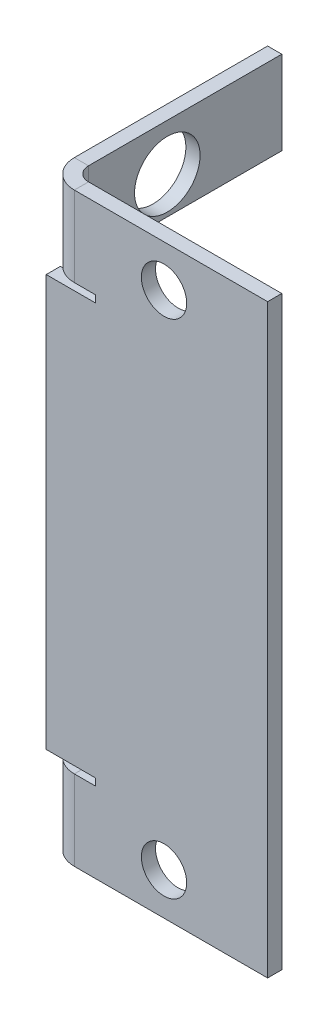
ISO-10303-21;
HEADER;
FILE_DESCRIPTION(('STEP AP214'),'2;1');
FILE_NAME('part.step','',(''),(''),'','','');
FILE_SCHEMA(('AUTOMOTIVE_DESIGN { 1 0 10303 214 1 1 1 1 }'));
ENDSEC;
DATA;
#1=APPLICATION_CONTEXT('core data for automotive mechanical design processes');
#2=APPLICATION_PROTOCOL_DEFINITION('international standard','automotive_design',2000,#1);
#3=PRODUCT_CONTEXT('',#1,'mechanical');
#4=PRODUCT('Part','Part','',(#3));
#5=PRODUCT_RELATED_PRODUCT_CATEGORY('part','',(#4));
#6=PRODUCT_DEFINITION_FORMATION('','',#4);
#7=PRODUCT_DEFINITION_CONTEXT('part definition',#1,'design');
#8=PRODUCT_DEFINITION('design','',#6,#7);
#9=PRODUCT_DEFINITION_SHAPE('','',#8);
#10=(LENGTH_UNIT() NAMED_UNIT(*) SI_UNIT(.MILLI.,.METRE.));
#11=(NAMED_UNIT(*) PLANE_ANGLE_UNIT() SI_UNIT($,.RADIAN.));
#12=(NAMED_UNIT(*) SI_UNIT($,.STERADIAN.) SOLID_ANGLE_UNIT());
#13=UNCERTAINTY_MEASURE_WITH_UNIT(LENGTH_MEASURE(1.E-05),#10,'distance_accuracy_value','');
#14=(GEOMETRIC_REPRESENTATION_CONTEXT(3) GLOBAL_UNCERTAINTY_ASSIGNED_CONTEXT((#13)) GLOBAL_UNIT_ASSIGNED_CONTEXT((#10,
#11,#12)) REPRESENTATION_CONTEXT('',''));
#15=CARTESIAN_POINT('',(0.,0.,0.));
#16=DIRECTION('',(0.,0.,1.));
#17=DIRECTION('',(1.,0.,0.));
#18=AXIS2_PLACEMENT_3D('',#15,#16,#17);
#19=CARTESIAN_POINT('',(1.016,5.746,-1.016));
#20=DIRECTION('',(0.,-1.,0.));
#21=DIRECTION('',(-1.,0.,0.));
#22=AXIS2_PLACEMENT_3D('',#19,#20,#21);
#23=PLANE('',#22);
#24=DIRECTION('',(0.,0.,-1.));
#25=VECTOR('',#24,1.);
#26=CARTESIAN_POINT('',(2.016,5.746,-1.016));
#27=LINE('',#26,#25);
#28=CARTESIAN_POINT('',(2.016,5.746,0.));
#29=VERTEX_POINT('',#28);
#30=CARTESIAN_POINT('',(2.016,5.746,-1.016));
#31=VERTEX_POINT('',#30);
#32=EDGE_CURVE('E11',#29,#31,#27,.T.);
#33=ORIENTED_EDGE('',*,*,#32,.F.);
#34=DIRECTION('',(-1.,0.,0.));
#35=VECTOR('',#34,1.);
#36=CARTESIAN_POINT('',(1.016,5.74600000000001,0.));
#37=LINE('',#36,#35);
#38=CARTESIAN_POINT('',(3.53999999999999,5.74600000000001,0.));
#39=VERTEX_POINT('',#38);
#40=EDGE_CURVE('E142',#39,#29,#37,.T.);
#41=ORIENTED_EDGE('',*,*,#40,.F.);
#42=DIRECTION('',(0.,0.,-1.));
#43=VECTOR('',#42,1.);
#44=CARTESIAN_POINT('',(3.53999999999999,5.746,-1.016));
#45=LINE('',#44,#43);
#46=CARTESIAN_POINT('',(3.53999999999999,5.746,-1.016));
#47=VERTEX_POINT('',#46);
#48=EDGE_CURVE('E54',#39,#47,#45,.T.);
#49=ORIENTED_EDGE('',*,*,#48,.T.);
#50=DIRECTION('',(-1.,0.,0.));
#51=VECTOR('',#50,1.);
#52=CARTESIAN_POINT('',(1.016,5.746,-1.016));
#53=LINE('',#52,#51);
#54=EDGE_CURVE('E145',#47,#31,#53,.T.);
#55=ORIENTED_EDGE('',*,*,#54,.T.);
#56=EDGE_LOOP('',(#33,#41,#49,#55));
#57=FACE_BOUND('',#56,.T.);
#58=ADVANCED_FACE('F44',(#57),#23,.F.);
#59=CARTESIAN_POINT('',(3.53999999999999,42.,-1.016));
#60=DIRECTION('',(1.,0.,0.));
#61=DIRECTION('',(0.,-1.,0.));
#62=AXIS2_PLACEMENT_3D('',#59,#60,#61);
#63=PLANE('',#62);
#64=ORIENTED_EDGE('',*,*,#48,.F.);
#65=DIRECTION('',(0.,1.,0.));
#66=VECTOR('',#65,1.);
#67=CARTESIAN_POINT('',(3.53999999999999,42.,0.));
#68=LINE('',#67,#66);
#69=CARTESIAN_POINT('',(3.53999999999999,6.25400000000001,0.));
#70=VERTEX_POINT('',#69);
#71=EDGE_CURVE('E174',#70,#39,#68,.F.);
#72=ORIENTED_EDGE('',*,*,#71,.F.);
#73=DIRECTION('',(0.,0.,-1.));
#74=VECTOR('',#73,1.);
#75=CARTESIAN_POINT('',(3.53999999999999,6.254,-1.016));
#76=LINE('',#75,#74);
#77=CARTESIAN_POINT('',(3.53999999999999,6.254,-1.016));
#78=VERTEX_POINT('',#77);
#79=EDGE_CURVE('E261',#70,#78,#76,.T.);
#80=ORIENTED_EDGE('',*,*,#79,.T.);
#81=DIRECTION('',(0.,-1.,0.));
#82=VECTOR('',#81,1.);
#83=CARTESIAN_POINT('',(3.53999999999999,42.,-1.016));
#84=LINE('',#83,#82);
#85=EDGE_CURVE('E276',#78,#47,#84,.T.);
#86=ORIENTED_EDGE('',*,*,#85,.T.);
#87=EDGE_LOOP('',(#64,#72,#80,#86));
#88=FACE_BOUND('',#87,.T.);
#89=ADVANCED_FACE('F284',(#88),#63,.F.);
#90=CARTESIAN_POINT('',(1.016,6.254,-1.016));
#91=DIRECTION('',(0.,1.,0.));
#92=DIRECTION('',(1.,0.,0.));
#93=AXIS2_PLACEMENT_3D('',#90,#91,#92);
#94=PLANE('',#93);
#95=ORIENTED_EDGE('',*,*,#79,.F.);
#96=DIRECTION('',(-1.,0.,0.));
#97=VECTOR('',#96,1.);
#98=CARTESIAN_POINT('',(1.016,6.25400000000001,0.));
#99=LINE('',#98,#97);
#100=CARTESIAN_POINT('',(0.,6.25400000000001,0.));
#101=VERTEX_POINT('',#100);
#102=EDGE_CURVE('E176',#101,#70,#99,.F.);
#103=ORIENTED_EDGE('',*,*,#102,.F.);
#104=DIRECTION('',(0.,0.,-1.));
#105=VECTOR('',#104,1.);
#106=CARTESIAN_POINT('',(0.,6.254,-1.016));
#107=LINE('',#106,#105);
#108=CARTESIAN_POINT('',(0.,6.254,-1.016));
#109=VERTEX_POINT('',#108);
#110=EDGE_CURVE('E258',#101,#109,#107,.T.);
#111=ORIENTED_EDGE('',*,*,#110,.T.);
#112=DIRECTION('',(1.,0.,0.));
#113=VECTOR('',#112,1.);
#114=CARTESIAN_POINT('',(1.016,6.254,-1.016));
#115=LINE('',#114,#113);
#116=EDGE_CURVE('E282',#109,#78,#115,.T.);
#117=ORIENTED_EDGE('',*,*,#116,.T.);
#118=EDGE_LOOP('',(#95,#103,#111,#117));
#119=FACE_BOUND('',#118,.T.);
#120=ADVANCED_FACE('F374',(#119),#94,.F.);
#121=CARTESIAN_POINT('',(0.,42.,-1.01599999999999));
#122=DIRECTION('',(-1.,0.,0.));
#123=DIRECTION('',(0.,1.,0.));
#124=AXIS2_PLACEMENT_3D('',#121,#122,#123);
#125=PLANE('',#124);
#126=ORIENTED_EDGE('',*,*,#110,.F.);
#127=DIRECTION('',(0.,1.,0.));
#128=VECTOR('',#127,1.);
#129=CARTESIAN_POINT('',(0.,42.,0.));
#130=LINE('',#129,#128);
#131=CARTESIAN_POINT('',(0.,35.746,0.));
#132=VERTEX_POINT('',#131);
#133=EDGE_CURVE('E339',#101,#132,#130,.T.);
#134=ORIENTED_EDGE('',*,*,#133,.T.);
#135=DIRECTION('',(0.,0.,-1.));
#136=VECTOR('',#135,1.);
#137=CARTESIAN_POINT('',(0.,35.746,-1.016));
#138=LINE('',#137,#136);
#139=CARTESIAN_POINT('',(0.,35.746,-1.016));
#140=VERTEX_POINT('',#139);
#141=EDGE_CURVE('E255',#132,#140,#138,.T.);
#142=ORIENTED_EDGE('',*,*,#141,.T.);
#143=DIRECTION('',(0.,1.,0.));
#144=VECTOR('',#143,1.);
#145=CARTESIAN_POINT('',(0.,42.,-1.01599999999999));
#146=LINE('',#145,#144);
#147=EDGE_CURVE('E381',#109,#140,#146,.T.);
#148=ORIENTED_EDGE('',*,*,#147,.F.);
#149=EDGE_LOOP('',(#126,#134,#142,#148));
#150=FACE_BOUND('',#149,.T.);
#151=ADVANCED_FACE('F385',(#150),#125,.T.);
#152=CARTESIAN_POINT('',(1.016,35.746,-1.016));
#153=DIRECTION('',(0.,-1.,0.));
#154=DIRECTION('',(-1.,0.,0.));
#155=AXIS2_PLACEMENT_3D('',#152,#153,#154);
#156=PLANE('',#155);
#157=ORIENTED_EDGE('',*,*,#141,.F.);
#158=DIRECTION('',(-1.,0.,0.));
#159=VECTOR('',#158,1.);
#160=CARTESIAN_POINT('',(1.016,35.746,0.));
#161=LINE('',#160,#159);
#162=CARTESIAN_POINT('',(3.53999999999999,35.746,0.));
#163=VERTEX_POINT('',#162);
#164=EDGE_CURVE('E364',#163,#132,#161,.T.);
#165=ORIENTED_EDGE('',*,*,#164,.F.);
#166=DIRECTION('',(0.,0.,-1.));
#167=VECTOR('',#166,1.);
#168=CARTESIAN_POINT('',(3.53999999999999,35.746,-1.016));
#169=LINE('',#168,#167);
#170=CARTESIAN_POINT('',(3.53999999999999,35.746,-1.016));
#171=VERTEX_POINT('',#170);
#172=EDGE_CURVE('E252',#163,#171,#169,.T.);
#173=ORIENTED_EDGE('',*,*,#172,.T.);
#174=DIRECTION('',(-1.,0.,0.));
#175=VECTOR('',#174,1.);
#176=CARTESIAN_POINT('',(1.016,35.746,-1.016));
#177=LINE('',#176,#175);
#178=EDGE_CURVE('E285',#171,#140,#177,.T.);
#179=ORIENTED_EDGE('',*,*,#178,.T.);
#180=EDGE_LOOP('',(#157,#165,#173,#179));
#181=FACE_BOUND('',#180,.T.);
#182=ADVANCED_FACE('F871',(#181),#156,.F.);
#183=CARTESIAN_POINT('',(3.53999999999999,42.,-1.016));
#184=DIRECTION('',(1.,0.,0.));
#185=DIRECTION('',(0.,-1.,0.));
#186=AXIS2_PLACEMENT_3D('',#183,#184,#185);
#187=PLANE('',#186);
#188=ORIENTED_EDGE('',*,*,#172,.F.);
#189=DIRECTION('',(0.,1.,0.));
#190=VECTOR('',#189,1.);
#191=CARTESIAN_POINT('',(3.53999999999999,42.,0.));
#192=LINE('',#191,#190);
#193=CARTESIAN_POINT('',(3.53999999999999,36.254,0.));
#194=VERTEX_POINT('',#193);
#195=EDGE_CURVE('E357',#194,#163,#192,.F.);
#196=ORIENTED_EDGE('',*,*,#195,.F.);
#197=DIRECTION('',(0.,0.,-1.));
#198=VECTOR('',#197,1.);
#199=CARTESIAN_POINT('',(3.53999999999999,36.254,-1.016));
#200=LINE('',#199,#198);
#201=CARTESIAN_POINT('',(3.53999999999999,36.254,-1.016));
#202=VERTEX_POINT('',#201);
#203=EDGE_CURVE('E249',#194,#202,#200,.T.);
#204=ORIENTED_EDGE('',*,*,#203,.T.);
#205=DIRECTION('',(0.,-1.,0.));
#206=VECTOR('',#205,1.);
#207=CARTESIAN_POINT('',(3.53999999999999,42.,-1.016));
#208=LINE('',#207,#206);
#209=EDGE_CURVE('E415',#202,#171,#208,.T.);
#210=ORIENTED_EDGE('',*,*,#209,.T.);
#211=EDGE_LOOP('',(#188,#196,#204,#210));
#212=FACE_BOUND('',#211,.T.);
#213=ADVANCED_FACE('F860',(#212),#187,.F.);
#214=CARTESIAN_POINT('',(1.016,36.254,-1.016));
#215=DIRECTION('',(0.,1.,0.));
#216=DIRECTION('',(1.,0.,0.));
#217=AXIS2_PLACEMENT_3D('',#214,#215,#216);
#218=PLANE('',#217);
#219=ORIENTED_EDGE('',*,*,#203,.F.);
#220=DIRECTION('',(-1.,0.,0.));
#221=VECTOR('',#220,1.);
#222=CARTESIAN_POINT('',(1.016,36.254,0.));
#223=LINE('',#222,#221);
#224=CARTESIAN_POINT('',(2.016,36.254,0.));
#225=VERTEX_POINT('',#224);
#226=EDGE_CURVE('E362',#225,#194,#223,.F.);
#227=ORIENTED_EDGE('',*,*,#226,.F.);
#228=DIRECTION('',(0.,0.,-1.));
#229=VECTOR('',#228,1.);
#230=CARTESIAN_POINT('',(2.016,36.254,-1.016));
#231=LINE('',#230,#229);
#232=CARTESIAN_POINT('',(2.016,36.254,-1.016));
#233=VERTEX_POINT('',#232);
#234=EDGE_CURVE('E247',#225,#233,#231,.T.);
#235=ORIENTED_EDGE('',*,*,#234,.T.);
#236=DIRECTION('',(1.,0.,0.));
#237=VECTOR('',#236,1.);
#238=CARTESIAN_POINT('',(1.016,36.254,-1.016));
#239=LINE('',#238,#237);
#240=EDGE_CURVE('E289',#233,#202,#239,.T.);
#241=ORIENTED_EDGE('',*,*,#240,.T.);
#242=EDGE_LOOP('',(#219,#227,#235,#241));
#243=FACE_BOUND('',#242,.T.);
#244=ADVANCED_FACE('F422',(#243),#218,.F.);
#245=CARTESIAN_POINT('',(2.016,36.254,-2.016));
#246=DIRECTION('',(0.,1.,0.));
#247=DIRECTION('',(0.,0.,1.));
#248=AXIS2_PLACEMENT_3D('',#245,#246,#247);
#249=PLANE('',#248);
#250=ORIENTED_EDGE('',*,*,#234,.F.);
#251=CARTESIAN_POINT('',(2.016,36.254,-2.016));
#252=DIRECTION('',(0.,-1.,0.));
#253=DIRECTION('',(0.,0.,-1.));
#254=AXIS2_PLACEMENT_3D('',#251,#252,#253);
#255=CIRCLE('',#254,2.016);
#256=CARTESIAN_POINT('',(0.,36.254,-2.016));
#257=VERTEX_POINT('',#256);
#258=EDGE_CURVE('E346',#225,#257,#255,.T.);
#259=ORIENTED_EDGE('',*,*,#258,.T.);
#260=DIRECTION('',(1.,0.,0.));
#261=VECTOR('',#260,1.);
#262=CARTESIAN_POINT('',(1.016,36.254,-2.016));
#263=LINE('',#262,#261);
#264=CARTESIAN_POINT('',(1.016,36.254,-2.016));
#265=VERTEX_POINT('',#264);
#266=EDGE_CURVE('E244',#257,#265,#263,.T.);
#267=ORIENTED_EDGE('',*,*,#266,.T.);
#268=CARTESIAN_POINT('',(2.016,36.254,-2.016));
#269=DIRECTION('',(0.,-1.,0.));
#270=DIRECTION('',(0.,0.,-1.));
#271=AXIS2_PLACEMENT_3D('',#268,#269,#270);
#272=CIRCLE('',#271,1.);
#273=EDGE_CURVE('E315',#233,#265,#272,.T.);
#274=ORIENTED_EDGE('',*,*,#273,.F.);
#275=EDGE_LOOP('',(#250,#259,#267,#274));
#276=FACE_BOUND('',#275,.T.);
#277=ADVANCED_FACE('F428',(#276),#249,.F.);
#278=CARTESIAN_POINT('',(1.016,36.254,-1.016));
#279=DIRECTION('',(0.,1.,0.));
#280=DIRECTION('',(0.,0.,-1.));
#281=AXIS2_PLACEMENT_3D('',#278,#279,#280);
#282=PLANE('',#281);
#283=ORIENTED_EDGE('',*,*,#266,.F.);
#284=DIRECTION('',(0.,0.,1.));
#285=VECTOR('',#284,1.);
#286=CARTESIAN_POINT('',(0.,36.254,-1.016));
#287=LINE('',#286,#285);
#288=CARTESIAN_POINT('',(0.,36.254,-3.53999999999999));
#289=VERTEX_POINT('',#288);
#290=EDGE_CURVE('E194',#257,#289,#287,.F.);
#291=ORIENTED_EDGE('',*,*,#290,.T.);
#292=DIRECTION('',(1.,0.,0.));
#293=VECTOR('',#292,1.);
#294=CARTESIAN_POINT('',(1.016,36.254,-3.53999999999999));
#295=LINE('',#294,#293);
#296=CARTESIAN_POINT('',(1.016,36.254,-3.53999999999999));
#297=VERTEX_POINT('',#296);
#298=EDGE_CURVE('E241',#289,#297,#295,.T.);
#299=ORIENTED_EDGE('',*,*,#298,.T.);
#300=DIRECTION('',(0.,0.,-1.));
#301=VECTOR('',#300,1.);
#302=CARTESIAN_POINT('',(1.016,36.254,-1.016));
#303=LINE('',#302,#301);
#304=EDGE_CURVE('E409',#265,#297,#303,.T.);
#305=ORIENTED_EDGE('',*,*,#304,.F.);
#306=EDGE_LOOP('',(#283,#291,#299,#305));
#307=FACE_BOUND('',#306,.T.);
#308=ADVANCED_FACE('F825',(#307),#282,.F.);
#309=CARTESIAN_POINT('',(1.016,42.,-3.53999999999999));
#310=DIRECTION('',(0.,0.,-1.));
#311=DIRECTION('',(0.,-1.,0.));
#312=AXIS2_PLACEMENT_3D('',#309,#310,#311);
#313=PLANE('',#312);
#314=ORIENTED_EDGE('',*,*,#298,.F.);
#315=DIRECTION('',(0.,1.,0.));
#316=VECTOR('',#315,1.);
#317=CARTESIAN_POINT('',(0.,42.,-3.53999999999999));
#318=LINE('',#317,#316);
#319=CARTESIAN_POINT('',(0.,36.,-3.53999999999999));
#320=VERTEX_POINT('',#319);
#321=EDGE_CURVE('E354',#289,#320,#318,.F.);
#322=ORIENTED_EDGE('',*,*,#321,.T.);
#323=DIRECTION('',(1.,0.,0.));
#324=VECTOR('',#323,1.);
#325=CARTESIAN_POINT('',(1.016,36.,-3.53999999999999));
#326=LINE('',#325,#324);
#327=CARTESIAN_POINT('',(1.016,36.,-3.53999999999999));
#328=VERTEX_POINT('',#327);
#329=EDGE_CURVE('E238',#320,#328,#326,.T.);
#330=ORIENTED_EDGE('',*,*,#329,.T.);
#331=DIRECTION('',(0.,-1.,0.));
#332=VECTOR('',#331,1.);
#333=CARTESIAN_POINT('',(1.016,42.,-3.53999999999999));
#334=LINE('',#333,#332);
#335=EDGE_CURVE('E412',#297,#328,#334,.T.);
#336=ORIENTED_EDGE('',*,*,#335,.F.);
#337=EDGE_LOOP('',(#314,#322,#330,#336));
#338=FACE_BOUND('',#337,.T.);
#339=ADVANCED_FACE('F813',(#338),#313,.F.);
#340=CARTESIAN_POINT('',(1.016,36.,-15.875));
#341=DIRECTION('',(0.,-1.,0.));
#342=DIRECTION('',(0.,0.,1.));
#343=AXIS2_PLACEMENT_3D('',#340,#341,#342);
#344=PLANE('',#343);
#345=ORIENTED_EDGE('',*,*,#329,.F.);
#346=DIRECTION('',(0.,0.,1.));
#347=VECTOR('',#346,1.);
#348=CARTESIAN_POINT('',(0.,36.,-1.016));
#349=LINE('',#348,#347);
#350=CARTESIAN_POINT('',(0.,36.,-15.875));
#351=VERTEX_POINT('',#350);
#352=EDGE_CURVE('E185',#351,#320,#349,.T.);
#353=ORIENTED_EDGE('',*,*,#352,.F.);
#354=DIRECTION('',(1.,0.,0.));
#355=VECTOR('',#354,1.);
#356=CARTESIAN_POINT('',(1.016,36.,-15.875));
#357=LINE('',#356,#355);
#358=CARTESIAN_POINT('',(1.016,36.,-15.875));
#359=VERTEX_POINT('',#358);
#360=EDGE_CURVE('E235',#351,#359,#357,.T.);
#361=ORIENTED_EDGE('',*,*,#360,.T.);
#362=DIRECTION('',(0.,0.,1.));
#363=VECTOR('',#362,1.);
#364=CARTESIAN_POINT('',(1.016,36.,-15.875));
#365=LINE('',#364,#363);
#366=EDGE_CURVE('E477',#359,#328,#365,.T.);
#367=ORIENTED_EDGE('',*,*,#366,.T.);
#368=EDGE_LOOP('',(#345,#353,#361,#367));
#369=FACE_BOUND('',#368,.T.);
#370=ADVANCED_FACE('F475',(#369),#344,.T.);
#371=CARTESIAN_POINT('',(1.016,42.,-15.875));
#372=DIRECTION('',(0.,0.,-1.));
#373=DIRECTION('',(0.,-1.,0.));
#374=AXIS2_PLACEMENT_3D('',#371,#372,#373);
#375=PLANE('',#374);
#376=ORIENTED_EDGE('',*,*,#360,.F.);
#377=DIRECTION('',(0.,1.,0.));
#378=VECTOR('',#377,1.);
#379=CARTESIAN_POINT('',(0.,42.,-15.875));
#380=LINE('',#379,#378);
#381=CARTESIAN_POINT('',(0.,42.,-15.875));
#382=VERTEX_POINT('',#381);
#383=EDGE_CURVE('E349',#382,#351,#380,.F.);
#384=ORIENTED_EDGE('',*,*,#383,.F.);
#385=DIRECTION('',(1.,0.,0.));
#386=VECTOR('',#385,1.);
#387=CARTESIAN_POINT('',(1.016,42.,-15.875));
#388=LINE('',#387,#386);
#389=CARTESIAN_POINT('',(1.016,42.,-15.875));
#390=VERTEX_POINT('',#389);
#391=EDGE_CURVE('E232',#382,#390,#388,.T.);
#392=ORIENTED_EDGE('',*,*,#391,.T.);
#393=DIRECTION('',(0.,-1.,0.));
#394=VECTOR('',#393,1.);
#395=CARTESIAN_POINT('',(1.016,42.,-15.875));
#396=LINE('',#395,#394);
#397=EDGE_CURVE('E471',#390,#359,#396,.T.);
#398=ORIENTED_EDGE('',*,*,#397,.T.);
#399=EDGE_LOOP('',(#376,#384,#392,#398));
#400=FACE_BOUND('',#399,.T.);
#401=ADVANCED_FACE('F468',(#400),#375,.T.);
#402=CARTESIAN_POINT('',(1.016,42.,-1.016));
#403=DIRECTION('',(0.,1.,0.));
#404=DIRECTION('',(0.,0.,-1.));
#405=AXIS2_PLACEMENT_3D('',#402,#403,#404);
#406=PLANE('',#405);
#407=ORIENTED_EDGE('',*,*,#391,.F.);
#408=DIRECTION('',(0.,0.,1.));
#409=VECTOR('',#408,1.);
#410=CARTESIAN_POINT('',(0.,42.,-1.016));
#411=LINE('',#410,#409);
#412=CARTESIAN_POINT('',(0.,42.,-2.016));
#413=VERTEX_POINT('',#412);
#414=EDGE_CURVE('E200',#413,#382,#411,.F.);
#415=ORIENTED_EDGE('',*,*,#414,.F.);
#416=DIRECTION('',(1.,0.,0.));
#417=VECTOR('',#416,1.);
#418=CARTESIAN_POINT('',(1.016,42.,-2.016));
#419=LINE('',#418,#417);
#420=CARTESIAN_POINT('',(1.016,42.,-2.016));
#421=VERTEX_POINT('',#420);
#422=EDGE_CURVE('E229',#413,#421,#419,.T.);
#423=ORIENTED_EDGE('',*,*,#422,.T.);
#424=DIRECTION('',(0.,0.,-1.));
#425=VECTOR('',#424,1.);
#426=CARTESIAN_POINT('',(1.016,42.,-1.016));
#427=LINE('',#426,#425);
#428=EDGE_CURVE('E483',#421,#390,#427,.T.);
#429=ORIENTED_EDGE('',*,*,#428,.T.);
#430=EDGE_LOOP('',(#407,#415,#423,#429));
#431=FACE_BOUND('',#430,.T.);
#432=ADVANCED_FACE('F460',(#431),#406,.T.);
#433=CARTESIAN_POINT('',(2.016,42.,-2.016));
#434=DIRECTION('',(0.,-1.,0.));
#435=DIRECTION('',(0.,0.,-1.));
#436=AXIS2_PLACEMENT_3D('',#433,#434,#435);
#437=PLANE('',#436);
#438=ORIENTED_EDGE('',*,*,#422,.F.);
#439=CARTESIAN_POINT('',(2.016,42.,-2.016));
#440=DIRECTION('',(0.,-1.,0.));
#441=DIRECTION('',(0.,0.,-1.));
#442=AXIS2_PLACEMENT_3D('',#439,#440,#441);
#443=CIRCLE('',#442,2.016);
#444=CARTESIAN_POINT('',(2.016,42.,0.));
#445=VERTEX_POINT('',#444);
#446=EDGE_CURVE('E187',#413,#445,#443,.F.);
#447=ORIENTED_EDGE('',*,*,#446,.T.);
#448=DIRECTION('',(0.,0.,-1.));
#449=VECTOR('',#448,1.);
#450=CARTESIAN_POINT('',(2.016,42.,-1.016));
#451=LINE('',#450,#449);
#452=CARTESIAN_POINT('',(2.016,42.,-1.016));
#453=VERTEX_POINT('',#452);
#454=EDGE_CURVE('E62',#445,#453,#451,.T.);
#455=ORIENTED_EDGE('',*,*,#454,.T.);
#456=CARTESIAN_POINT('',(2.016,42.,-2.016));
#457=DIRECTION('',(0.,1.,0.));
#458=DIRECTION('',(0.,0.,1.));
#459=AXIS2_PLACEMENT_3D('',#456,#457,#458);
#460=CIRCLE('',#459,1.);
#461=EDGE_CURVE('E307',#421,#453,#460,.T.);
#462=ORIENTED_EDGE('',*,*,#461,.F.);
#463=EDGE_LOOP('',(#438,#447,#455,#462));
#464=FACE_BOUND('',#463,.T.);
#465=ADVANCED_FACE('F453',(#464),#437,.F.);
#466=CARTESIAN_POINT('',(1.016,42.,-1.016));
#467=DIRECTION('',(0.,1.,0.));
#468=DIRECTION('',(1.,0.,0.));
#469=AXIS2_PLACEMENT_3D('',#466,#467,#468);
#470=PLANE('',#469);
#471=ORIENTED_EDGE('',*,*,#454,.F.);
#472=DIRECTION('',(-1.,0.,0.));
#473=VECTOR('',#472,1.);
#474=CARTESIAN_POINT('',(1.016,42.,0.));
#475=LINE('',#474,#473);
#476=CARTESIAN_POINT('',(15.875,42.,0.));
#477=VERTEX_POINT('',#476);
#478=EDGE_CURVE('E342',#445,#477,#475,.F.);
#479=ORIENTED_EDGE('',*,*,#478,.T.);
#480=DIRECTION('',(0.,0.,-1.));
#481=VECTOR('',#480,1.);
#482=CARTESIAN_POINT('',(15.875,42.,-1.016));
#483=LINE('',#482,#481);
#484=CARTESIAN_POINT('',(15.875,42.,-1.016));
#485=VERTEX_POINT('',#484);
#486=EDGE_CURVE('E225',#477,#485,#483,.T.);
#487=ORIENTED_EDGE('',*,*,#486,.T.);
#488=DIRECTION('',(1.,0.,0.));
#489=VECTOR('',#488,1.);
#490=CARTESIAN_POINT('',(1.016,42.,-1.016));
#491=LINE('',#490,#489);
#492=EDGE_CURVE('E386',#453,#485,#491,.T.);
#493=ORIENTED_EDGE('',*,*,#492,.F.);
#494=EDGE_LOOP('',(#471,#479,#487,#493));
#495=FACE_BOUND('',#494,.T.);
#496=ADVANCED_FACE('F437',(#495),#470,.T.);
#497=CARTESIAN_POINT('',(15.875,42.,-1.016));
#498=DIRECTION('',(1.,0.,0.));
#499=DIRECTION('',(0.,-1.,0.));
#500=AXIS2_PLACEMENT_3D('',#497,#498,#499);
#501=PLANE('',#500);
#502=ORIENTED_EDGE('',*,*,#486,.F.);
#503=DIRECTION('',(0.,1.,0.));
#504=VECTOR('',#503,1.);
#505=CARTESIAN_POINT('',(15.875,42.,0.));
#506=LINE('',#505,#504);
#507=CARTESIAN_POINT('',(15.875,0.,0.));
#508=VERTEX_POINT('',#507);
#509=EDGE_CURVE('E335',#477,#508,#506,.F.);
#510=ORIENTED_EDGE('',*,*,#509,.T.);
#511=DIRECTION('',(0.,0.,-1.));
#512=VECTOR('',#511,1.);
#513=CARTESIAN_POINT('',(15.875,0.,-1.016));
#514=LINE('',#513,#512);
#515=CARTESIAN_POINT('',(15.875,0.,-1.016));
#516=VERTEX_POINT('',#515);
#517=EDGE_CURVE('E222',#508,#516,#514,.T.);
#518=ORIENTED_EDGE('',*,*,#517,.T.);
#519=DIRECTION('',(0.,-1.,0.));
#520=VECTOR('',#519,1.);
#521=CARTESIAN_POINT('',(15.875,42.,-1.016));
#522=LINE('',#521,#520);
#523=EDGE_CURVE('E390',#485,#516,#522,.T.);
#524=ORIENTED_EDGE('',*,*,#523,.F.);
#525=EDGE_LOOP('',(#502,#510,#518,#524));
#526=FACE_BOUND('',#525,.T.);
#527=ADVANCED_FACE('F444',(#526),#501,.T.);
#528=CARTESIAN_POINT('',(1.016,0.,-1.016));
#529=DIRECTION('',(0.,1.,0.));
#530=DIRECTION('',(1.,0.,0.));
#531=AXIS2_PLACEMENT_3D('',#528,#529,#530);
#532=PLANE('',#531);
#533=ORIENTED_EDGE('',*,*,#517,.F.);
#534=DIRECTION('',(-1.,0.,0.));
#535=VECTOR('',#534,1.);
#536=CARTESIAN_POINT('',(1.016,0.,0.));
#537=LINE('',#536,#535);
#538=CARTESIAN_POINT('',(2.016,0.,0.));
#539=VERTEX_POINT('',#538);
#540=EDGE_CURVE('E202',#539,#508,#537,.F.);
#541=ORIENTED_EDGE('',*,*,#540,.F.);
#542=DIRECTION('',(0.,0.,-1.));
#543=VECTOR('',#542,1.);
#544=CARTESIAN_POINT('',(2.016,0.,-1.016));
#545=LINE('',#544,#543);
#546=CARTESIAN_POINT('',(2.016,0.,-1.016));
#547=VERTEX_POINT('',#546);
#548=EDGE_CURVE('E219',#539,#547,#545,.T.);
#549=ORIENTED_EDGE('',*,*,#548,.T.);
#550=DIRECTION('',(1.,0.,0.));
#551=VECTOR('',#550,1.);
#552=CARTESIAN_POINT('',(1.016,0.,-1.016));
#553=LINE('',#552,#551);
#554=EDGE_CURVE('E387',#547,#516,#553,.T.);
#555=ORIENTED_EDGE('',*,*,#554,.T.);
#556=EDGE_LOOP('',(#533,#541,#549,#555));
#557=FACE_BOUND('',#556,.T.);
#558=ADVANCED_FACE('F449',(#557),#532,.F.);
#559=CARTESIAN_POINT('',(2.016,0.,-2.016));
#560=DIRECTION('',(0.,1.,0.));
#561=DIRECTION('',(0.,0.,1.));
#562=AXIS2_PLACEMENT_3D('',#559,#560,#561);
#563=PLANE('',#562);
#564=ORIENTED_EDGE('',*,*,#548,.F.);
#565=CARTESIAN_POINT('',(2.016,0.,-2.016));
#566=DIRECTION('',(0.,-1.,0.));
#567=DIRECTION('',(0.,0.,-1.));
#568=AXIS2_PLACEMENT_3D('',#565,#566,#567);
#569=CIRCLE('',#568,2.016);
#570=CARTESIAN_POINT('',(0.,0.,-2.016));
#571=VERTEX_POINT('',#570);
#572=EDGE_CURVE('E161',#539,#571,#569,.T.);
#573=ORIENTED_EDGE('',*,*,#572,.T.);
#574=DIRECTION('',(1.,0.,0.));
#575=VECTOR('',#574,1.);
#576=CARTESIAN_POINT('',(1.016,0.,-2.016));
#577=LINE('',#576,#575);
#578=CARTESIAN_POINT('',(1.016,0.,-2.016));
#579=VERTEX_POINT('',#578);
#580=EDGE_CURVE('E216',#571,#579,#577,.T.);
#581=ORIENTED_EDGE('',*,*,#580,.T.);
#582=CARTESIAN_POINT('',(2.016,0.,-2.016));
#583=DIRECTION('',(0.,-1.,0.));
#584=DIRECTION('',(0.,0.,-1.));
#585=AXIS2_PLACEMENT_3D('',#582,#583,#584);
#586=CIRCLE('',#585,1.);
#587=EDGE_CURVE('E303',#547,#579,#586,.T.);
#588=ORIENTED_EDGE('',*,*,#587,.F.);
#589=EDGE_LOOP('',(#564,#573,#581,#588));
#590=FACE_BOUND('',#589,.T.);
#591=ADVANCED_FACE('F727',(#590),#563,.F.);
#592=CARTESIAN_POINT('',(1.016,0.,-1.016));
#593=DIRECTION('',(0.,1.,0.));
#594=DIRECTION('',(0.,0.,-1.));
#595=AXIS2_PLACEMENT_3D('',#592,#593,#594);
#596=PLANE('',#595);
#597=ORIENTED_EDGE('',*,*,#580,.F.);
#598=DIRECTION('',(0.,0.,1.));
#599=VECTOR('',#598,1.);
#600=CARTESIAN_POINT('',(0.,0.,-1.016));
#601=LINE('',#600,#599);
#602=CARTESIAN_POINT('',(0.,0.,-15.875));
#603=VERTEX_POINT('',#602);
#604=EDGE_CURVE('E195',#571,#603,#601,.F.);
#605=ORIENTED_EDGE('',*,*,#604,.T.);
#606=DIRECTION('',(1.,0.,0.));
#607=VECTOR('',#606,1.);
#608=CARTESIAN_POINT('',(1.016,0.,-15.875));
#609=LINE('',#608,#607);
#610=CARTESIAN_POINT('',(1.016,0.,-15.875));
#611=VERTEX_POINT('',#610);
#612=EDGE_CURVE('E213',#603,#611,#609,.T.);
#613=ORIENTED_EDGE('',*,*,#612,.T.);
#614=DIRECTION('',(0.,0.,-1.));
#615=VECTOR('',#614,1.);
#616=CARTESIAN_POINT('',(1.016,0.,-1.016));
#617=LINE('',#616,#615);
#618=EDGE_CURVE('E403',#579,#611,#617,.T.);
#619=ORIENTED_EDGE('',*,*,#618,.F.);
#620=EDGE_LOOP('',(#597,#605,#613,#619));
#621=FACE_BOUND('',#620,.T.);
#622=ADVANCED_FACE('F714',(#621),#596,.F.);
#623=ORIENTED_EDGE('',*,*,#612,.F.);
#624=DIRECTION('',(0.,1.,0.));
#625=VECTOR('',#624,1.);
#626=CARTESIAN_POINT('',(0.,42.,-15.875));
#627=LINE('',#626,#625);
#628=CARTESIAN_POINT('',(0.,6.00000000000001,-15.875));
#629=VERTEX_POINT('',#628);
#630=EDGE_CURVE('E332',#629,#603,#627,.F.);
#631=ORIENTED_EDGE('',*,*,#630,.F.);
#632=DIRECTION('',(1.,0.,0.));
#633=VECTOR('',#632,1.);
#634=CARTESIAN_POINT('',(1.016,6.,-15.875));
#635=LINE('',#634,#633);
#636=CARTESIAN_POINT('',(1.016,6.,-15.875));
#637=VERTEX_POINT('',#636);
#638=EDGE_CURVE('E210',#629,#637,#635,.T.);
#639=ORIENTED_EDGE('',*,*,#638,.T.);
#640=EDGE_CURVE('E399',#637,#611,#396,.T.);
#641=ORIENTED_EDGE('',*,*,#640,.T.);
#642=EDGE_LOOP('',(#623,#631,#639,#641));
#643=FACE_BOUND('',#642,.T.);
#644=ADVANCED_FACE('F701',(#643),#375,.T.);
#645=CARTESIAN_POINT('',(1.016,6.,-1.016));
#646=DIRECTION('',(0.,1.,0.));
#647=DIRECTION('',(0.,0.,-1.));
#648=AXIS2_PLACEMENT_3D('',#645,#646,#647);
#649=PLANE('',#648);
#650=ORIENTED_EDGE('',*,*,#638,.F.);
#651=DIRECTION('',(0.,0.,1.));
#652=VECTOR('',#651,1.);
#653=CARTESIAN_POINT('',(0.,6.00000000000001,-1.016));
#654=LINE('',#653,#652);
#655=CARTESIAN_POINT('',(0.,6.00000000000001,-3.53999999999998));
#656=VERTEX_POINT('',#655);
#657=EDGE_CURVE('E329',#656,#629,#654,.F.);
#658=ORIENTED_EDGE('',*,*,#657,.F.);
#659=DIRECTION('',(1.,0.,0.));
#660=VECTOR('',#659,1.);
#661=CARTESIAN_POINT('',(1.016,6.,-3.53999999999998));
#662=LINE('',#661,#660);
#663=CARTESIAN_POINT('',(1.016,6.,-3.53999999999998));
#664=VERTEX_POINT('',#663);
#665=EDGE_CURVE('E207',#656,#664,#662,.T.);
#666=ORIENTED_EDGE('',*,*,#665,.T.);
#667=DIRECTION('',(0.,0.,-1.));
#668=VECTOR('',#667,1.);
#669=CARTESIAN_POINT('',(1.016,6.,-1.016));
#670=LINE('',#669,#668);
#671=EDGE_CURVE('E400',#664,#637,#670,.T.);
#672=ORIENTED_EDGE('',*,*,#671,.T.);
#673=EDGE_LOOP('',(#650,#658,#666,#672));
#674=FACE_BOUND('',#673,.T.);
#675=ADVANCED_FACE('F688',(#674),#649,.T.);
#676=CARTESIAN_POINT('',(1.016,42.,-3.53999999999998));
#677=DIRECTION('',(0.,0.,-1.));
#678=DIRECTION('',(0.,-1.,0.));
#679=AXIS2_PLACEMENT_3D('',#676,#677,#678);
#680=PLANE('',#679);
#681=ORIENTED_EDGE('',*,*,#665,.F.);
#682=DIRECTION('',(0.,1.,0.));
#683=VECTOR('',#682,1.);
#684=CARTESIAN_POINT('',(0.,42.,-3.53999999999998));
#685=LINE('',#684,#683);
#686=CARTESIAN_POINT('',(0.,5.74600000000001,-3.53999999999998));
#687=VERTEX_POINT('',#686);
#688=EDGE_CURVE('E175',#656,#687,#685,.F.);
#689=ORIENTED_EDGE('',*,*,#688,.T.);
#690=DIRECTION('',(1.,0.,0.));
#691=VECTOR('',#690,1.);
#692=CARTESIAN_POINT('',(1.016,5.746,-3.53999999999998));
#693=LINE('',#692,#691);
#694=CARTESIAN_POINT('',(1.016,5.746,-3.53999999999998));
#695=VERTEX_POINT('',#694);
#696=EDGE_CURVE('E204',#687,#695,#693,.T.);
#697=ORIENTED_EDGE('',*,*,#696,.T.);
#698=DIRECTION('',(0.,-1.,0.));
#699=VECTOR('',#698,1.);
#700=CARTESIAN_POINT('',(1.016,42.,-3.53999999999998));
#701=LINE('',#700,#699);
#702=EDGE_CURVE('E281',#664,#695,#701,.T.);
#703=ORIENTED_EDGE('',*,*,#702,.F.);
#704=EDGE_LOOP('',(#681,#689,#697,#703));
#705=FACE_BOUND('',#704,.T.);
#706=ADVANCED_FACE('F676',(#705),#680,.F.);
#707=CARTESIAN_POINT('',(1.016,5.746,-1.01600000000001));
#708=DIRECTION('',(0.,-1.,0.));
#709=DIRECTION('',(0.,0.,1.));
#710=AXIS2_PLACEMENT_3D('',#707,#708,#709);
#711=PLANE('',#710);
#712=ORIENTED_EDGE('',*,*,#696,.F.);
#713=DIRECTION('',(0.,0.,1.));
#714=VECTOR('',#713,1.);
#715=CARTESIAN_POINT('',(0.,5.74600000000001,-1.016));
#716=LINE('',#715,#714);
#717=CARTESIAN_POINT('',(0.,5.74600000000001,-2.016));
#718=VERTEX_POINT('',#717);
#719=EDGE_CURVE('E320',#687,#718,#716,.T.);
#720=ORIENTED_EDGE('',*,*,#719,.T.);
#721=DIRECTION('',(1.,0.,0.));
#722=VECTOR('',#721,1.);
#723=CARTESIAN_POINT('',(1.016,5.746,-2.016));
#724=LINE('',#723,#722);
#725=CARTESIAN_POINT('',(1.016,5.746,-2.016));
#726=VERTEX_POINT('',#725);
#727=EDGE_CURVE('E48',#718,#726,#724,.T.);
#728=ORIENTED_EDGE('',*,*,#727,.T.);
#729=DIRECTION('',(0.,0.,1.));
#730=VECTOR('',#729,1.);
#731=CARTESIAN_POINT('',(1.016,5.746,-1.01600000000001));
#732=LINE('',#731,#730);
#733=EDGE_CURVE('E295',#695,#726,#732,.T.);
#734=ORIENTED_EDGE('',*,*,#733,.F.);
#735=EDGE_LOOP('',(#712,#720,#728,#734));
#736=FACE_BOUND('',#735,.T.);
#737=ADVANCED_FACE('F664',(#736),#711,.F.);
#738=CARTESIAN_POINT('',(1.016,38.65,-7.666));
#739=DIRECTION('',(1.,0.,0.));
#740=DIRECTION('',(0.,0.,-1.));
#741=AXIS2_PLACEMENT_3D('',#738,#739,#740);
#742=CYLINDRICAL_SURFACE('',#741,2.35);
#743=CARTESIAN_POINT('',(1.016,38.65,-7.666));
#744=DIRECTION('',(1.,0.,0.));
#745=DIRECTION('',(0.,0.,-1.));
#746=AXIS2_PLACEMENT_3D('',#743,#744,#745);
#747=CIRCLE('',#746,2.35);
#748=CARTESIAN_POINT('',(1.016,38.65,-10.016));
#749=VERTEX_POINT('',#748);
#750=EDGE_CURVE('E309',#749,#749,#747,.T.);
#751=ORIENTED_EDGE('',*,*,#750,.T.);
#752=EDGE_LOOP('',(#751));
#753=FACE_BOUND('',#752,.T.);
#754=CARTESIAN_POINT('',(0.,38.65,-7.666));
#755=DIRECTION('',(1.,0.,0.));
#756=DIRECTION('',(0.,0.,-1.));
#757=AXIS2_PLACEMENT_3D('',#754,#755,#756);
#758=CIRCLE('',#757,2.35);
#759=CARTESIAN_POINT('',(0.,38.65,-10.016));
#760=VERTEX_POINT('',#759);
#761=EDGE_CURVE('E182',#760,#760,#758,.T.);
#762=ORIENTED_EDGE('',*,*,#761,.F.);
#763=EDGE_LOOP('',(#762));
#764=FACE_BOUND('',#763,.T.);
#765=ADVANCED_FACE('F46',(#753,#764),#742,.F.);
#766=CARTESIAN_POINT('',(8.4455,3.,-1.016));
#767=DIRECTION('',(0.,0.,-1.));
#768=DIRECTION('',(-1.,0.,0.));
#769=AXIS2_PLACEMENT_3D('',#766,#767,#768);
#770=CYLINDRICAL_SURFACE('',#769,1.625);
#771=CARTESIAN_POINT('',(8.4455,3.,-1.016));
#772=DIRECTION('',(0.,0.,-1.));
#773=DIRECTION('',(-1.,0.,0.));
#774=AXIS2_PLACEMENT_3D('',#771,#772,#773);
#775=CIRCLE('',#774,1.625);
#776=CARTESIAN_POINT('',(6.82049999999999,3.,-1.016));
#777=VERTEX_POINT('',#776);
#778=EDGE_CURVE('E489',#777,#777,#775,.T.);
#779=ORIENTED_EDGE('',*,*,#778,.T.);
#780=EDGE_LOOP('',(#779));
#781=FACE_BOUND('',#780,.T.);
#782=CARTESIAN_POINT('',(8.4455,3.,0.));
#783=DIRECTION('',(0.,0.,-1.));
#784=DIRECTION('',(-1.,0.,0.));
#785=AXIS2_PLACEMENT_3D('',#782,#783,#784);
#786=CIRCLE('',#785,1.625);
#787=CARTESIAN_POINT('',(6.82049999999999,3.,0.));
#788=VERTEX_POINT('',#787);
#789=EDGE_CURVE('E196',#788,#788,#786,.T.);
#790=ORIENTED_EDGE('',*,*,#789,.F.);
#791=EDGE_LOOP('',(#790));
#792=FACE_BOUND('',#791,.T.);
#793=ADVANCED_FACE('F524',(#781,#792),#770,.F.);
#794=CARTESIAN_POINT('',(8.4455,39.,-1.016));
#795=DIRECTION('',(0.,0.,-1.));
#796=DIRECTION('',(-1.,0.,0.));
#797=AXIS2_PLACEMENT_3D('',#794,#795,#796);
#798=CYLINDRICAL_SURFACE('',#797,1.625);
#799=CARTESIAN_POINT('',(8.4455,39.,-1.016));
#800=DIRECTION('',(0.,0.,-1.));
#801=DIRECTION('',(-1.,0.,0.));
#802=AXIS2_PLACEMENT_3D('',#799,#800,#801);
#803=CIRCLE('',#802,1.625);
#804=CARTESIAN_POINT('',(6.8205,39.,-1.016));
#805=VERTEX_POINT('',#804);
#806=EDGE_CURVE('E393',#805,#805,#803,.T.);
#807=ORIENTED_EDGE('',*,*,#806,.T.);
#808=EDGE_LOOP('',(#807));
#809=FACE_BOUND('',#808,.T.);
#810=CARTESIAN_POINT('',(8.4455,39.,0.));
#811=DIRECTION('',(0.,0.,-1.));
#812=DIRECTION('',(-1.,0.,0.));
#813=AXIS2_PLACEMENT_3D('',#810,#811,#812);
#814=CIRCLE('',#813,1.625);
#815=CARTESIAN_POINT('',(6.8205,39.,0.));
#816=VERTEX_POINT('',#815);
#817=EDGE_CURVE('E199',#816,#816,#814,.T.);
#818=ORIENTED_EDGE('',*,*,#817,.F.);
#819=EDGE_LOOP('',(#818));
#820=FACE_BOUND('',#819,.T.);
#821=ADVANCED_FACE('F494',(#809,#820),#798,.F.);
#822=CARTESIAN_POINT('',(1.016,3.35,-7.666));
#823=DIRECTION('',(1.,0.,0.));
#824=DIRECTION('',(0.,0.,-1.));
#825=AXIS2_PLACEMENT_3D('',#822,#823,#824);
#826=CYLINDRICAL_SURFACE('',#825,2.35);
#827=CARTESIAN_POINT('',(1.016,3.35,-7.666));
#828=DIRECTION('',(1.,0.,0.));
#829=DIRECTION('',(0.,0.,-1.));
#830=AXIS2_PLACEMENT_3D('',#827,#828,#829);
#831=CIRCLE('',#830,2.35);
#832=CARTESIAN_POINT('',(1.016,3.35,-10.016));
#833=VERTEX_POINT('',#832);
#834=EDGE_CURVE('E406',#833,#833,#831,.F.);
#835=ORIENTED_EDGE('',*,*,#834,.F.);
#836=EDGE_LOOP('',(#835));
#837=FACE_BOUND('',#836,.T.);
#838=CARTESIAN_POINT('',(0.,3.35,-7.666));
#839=DIRECTION('',(1.,0.,0.));
#840=DIRECTION('',(0.,0.,-1.));
#841=AXIS2_PLACEMENT_3D('',#838,#839,#840);
#842=CIRCLE('',#841,2.35);
#843=CARTESIAN_POINT('',(0.,3.35,-10.016));
#844=VERTEX_POINT('',#843);
#845=EDGE_CURVE('E191',#844,#844,#842,.F.);
#846=ORIENTED_EDGE('',*,*,#845,.T.);
#847=EDGE_LOOP('',(#846));
#848=FACE_BOUND('',#847,.T.);
#849=ADVANCED_FACE('F520',(#837,#848),#826,.F.);
#850=CARTESIAN_POINT('',(2.016,5.746,-2.016));
#851=DIRECTION('',(0.,-1.,0.));
#852=DIRECTION('',(0.,0.,-1.));
#853=AXIS2_PLACEMENT_3D('',#850,#851,#852);
#854=PLANE('',#853);
#855=CARTESIAN_POINT('',(2.016,5.746,-2.016));
#856=DIRECTION('',(0.,-1.,0.));
#857=DIRECTION('',(0.,0.,-1.));
#858=AXIS2_PLACEMENT_3D('',#855,#856,#857);
#859=CIRCLE('',#858,2.016);
#860=EDGE_CURVE('E158',#718,#29,#859,.F.);
#861=ORIENTED_EDGE('',*,*,#860,.T.);
#862=ORIENTED_EDGE('',*,*,#32,.T.);
#863=CARTESIAN_POINT('',(2.016,5.746,-2.016));
#864=DIRECTION('',(0.,1.,0.));
#865=DIRECTION('',(0.,0.,1.));
#866=AXIS2_PLACEMENT_3D('',#863,#864,#865);
#867=CIRCLE('',#866,1.);
#868=EDGE_CURVE('E306',#726,#31,#867,.T.);
#869=ORIENTED_EDGE('',*,*,#868,.F.);
#870=ORIENTED_EDGE('',*,*,#727,.F.);
#871=EDGE_LOOP('',(#861,#862,#869,#870));
#872=FACE_BOUND('',#871,.T.);
#873=ADVANCED_FACE('F179',(#872),#854,.F.);
#874=CARTESIAN_POINT('',(1.016,42.,-1.016));
#875=DIRECTION('',(-1.,0.,0.));
#876=DIRECTION('',(0.,0.,1.));
#877=AXIS2_PLACEMENT_3D('',#874,#875,#876);
#878=PLANE('',#877);
#879=ORIENTED_EDGE('',*,*,#733,.T.);
#880=DIRECTION('',(0.,-1.,0.));
#881=VECTOR('',#880,1.);
#882=CARTESIAN_POINT('',(1.016,42.,-2.016));
#883=LINE('',#882,#881);
#884=EDGE_CURVE('E298',#726,#579,#883,.T.);
#885=ORIENTED_EDGE('',*,*,#884,.T.);
#886=ORIENTED_EDGE('',*,*,#618,.T.);
#887=ORIENTED_EDGE('',*,*,#640,.F.);
#888=ORIENTED_EDGE('',*,*,#671,.F.);
#889=ORIENTED_EDGE('',*,*,#702,.T.);
#890=EDGE_LOOP('',(#879,#885,#886,#887,#888,#889));
#891=FACE_BOUND('',#890,.T.);
#892=ORIENTED_EDGE('',*,*,#834,.T.);
#893=EDGE_LOOP('',(#892));
#894=FACE_BOUND('',#893,.T.);
#895=ADVANCED_FACE('F498',(#891,#894),#878,.F.);
#896=CARTESIAN_POINT('',(1.016,42.,-1.016));
#897=DIRECTION('',(0.,0.,-1.));
#898=DIRECTION('',(-1.,0.,0.));
#899=AXIS2_PLACEMENT_3D('',#896,#897,#898);
#900=PLANE('',#899);
#901=ORIENTED_EDGE('',*,*,#240,.F.);
#902=DIRECTION('',(0.,-1.,0.));
#903=VECTOR('',#902,1.);
#904=CARTESIAN_POINT('',(2.016,42.,-1.016));
#905=LINE('',#904,#903);
#906=EDGE_CURVE('E312',#233,#453,#905,.F.);
#907=ORIENTED_EDGE('',*,*,#906,.T.);
#908=ORIENTED_EDGE('',*,*,#492,.T.);
#909=ORIENTED_EDGE('',*,*,#523,.T.);
#910=ORIENTED_EDGE('',*,*,#554,.F.);
#911=DIRECTION('',(0.,-1.,0.));
#912=VECTOR('',#911,1.);
#913=CARTESIAN_POINT('',(2.016,42.,-1.016));
#914=LINE('',#913,#912);
#915=EDGE_CURVE('E280',#547,#31,#914,.F.);
#916=ORIENTED_EDGE('',*,*,#915,.T.);
#917=ORIENTED_EDGE('',*,*,#54,.F.);
#918=ORIENTED_EDGE('',*,*,#85,.F.);
#919=ORIENTED_EDGE('',*,*,#116,.F.);
#920=ORIENTED_EDGE('',*,*,#147,.T.);
#921=ORIENTED_EDGE('',*,*,#178,.F.);
#922=ORIENTED_EDGE('',*,*,#209,.F.);
#923=EDGE_LOOP('',(#901,#907,#908,#909,#910,#916,#917,#918,#919,#920,#921,#922));
#924=FACE_BOUND('',#923,.T.);
#925=ORIENTED_EDGE('',*,*,#778,.F.);
#926=EDGE_LOOP('',(#925));
#927=FACE_BOUND('',#926,.T.);
#928=ORIENTED_EDGE('',*,*,#806,.F.);
#929=EDGE_LOOP('',(#928));
#930=FACE_BOUND('',#929,.T.);
#931=ADVANCED_FACE('F273',(#924,#927,#930),#900,.T.);
#932=ORIENTED_EDGE('',*,*,#750,.F.);
#933=EDGE_LOOP('',(#932));
#934=FACE_BOUND('',#933,.T.);
#935=ORIENTED_EDGE('',*,*,#428,.F.);
#936=DIRECTION('',(0.,-1.,0.));
#937=VECTOR('',#936,1.);
#938=CARTESIAN_POINT('',(1.016,42.,-2.016));
#939=LINE('',#938,#937);
#940=EDGE_CURVE('E302',#421,#265,#939,.T.);
#941=ORIENTED_EDGE('',*,*,#940,.T.);
#942=ORIENTED_EDGE('',*,*,#304,.T.);
#943=ORIENTED_EDGE('',*,*,#335,.T.);
#944=ORIENTED_EDGE('',*,*,#366,.F.);
#945=ORIENTED_EDGE('',*,*,#397,.F.);
#946=EDGE_LOOP('',(#935,#941,#942,#943,#944,#945));
#947=FACE_BOUND('',#946,.T.);
#948=ADVANCED_FACE('F480',(#934,#947),#878,.F.);
#949=CARTESIAN_POINT('',(2.016,42.,-2.016));
#950=DIRECTION('',(0.,-1.,0.));
#951=DIRECTION('',(0.,0.,-1.));
#952=AXIS2_PLACEMENT_3D('',#949,#950,#951);
#953=CYLINDRICAL_SURFACE('',#952,1.);
#954=ORIENTED_EDGE('',*,*,#868,.T.);
#955=ORIENTED_EDGE('',*,*,#915,.F.);
#956=ORIENTED_EDGE('',*,*,#587,.T.);
#957=ORIENTED_EDGE('',*,*,#884,.F.);
#958=EDGE_LOOP('',(#954,#955,#956,#957));
#959=FACE_BOUND('',#958,.T.);
#960=ADVANCED_FACE('F504',(#959),#953,.F.);
#961=CARTESIAN_POINT('',(2.016,42.,-2.016));
#962=DIRECTION('',(0.,-1.,0.));
#963=DIRECTION('',(0.,0.,-1.));
#964=AXIS2_PLACEMENT_3D('',#961,#962,#963);
#965=CYLINDRICAL_SURFACE('',#964,1.);
#966=ORIENTED_EDGE('',*,*,#461,.T.);
#967=ORIENTED_EDGE('',*,*,#906,.F.);
#968=ORIENTED_EDGE('',*,*,#273,.T.);
#969=ORIENTED_EDGE('',*,*,#940,.F.);
#970=EDGE_LOOP('',(#966,#967,#968,#969));
#971=FACE_BOUND('',#970,.T.);
#972=ADVANCED_FACE('F434',(#971),#965,.F.);
#973=CARTESIAN_POINT('',(0.,42.,-1.016));
#974=DIRECTION('',(-1.,0.,0.));
#975=DIRECTION('',(0.,0.,1.));
#976=AXIS2_PLACEMENT_3D('',#973,#974,#975);
#977=PLANE('',#976);
#978=ORIENTED_EDGE('',*,*,#719,.F.);
#979=ORIENTED_EDGE('',*,*,#688,.F.);
#980=ORIENTED_EDGE('',*,*,#657,.T.);
#981=ORIENTED_EDGE('',*,*,#630,.T.);
#982=ORIENTED_EDGE('',*,*,#604,.F.);
#983=DIRECTION('',(0.,1.,0.));
#984=VECTOR('',#983,1.);
#985=CARTESIAN_POINT('',(0.,42.,-2.016));
#986=LINE('',#985,#984);
#987=EDGE_CURVE('E166',#718,#571,#986,.F.);
#988=ORIENTED_EDGE('',*,*,#987,.F.);
#989=EDGE_LOOP('',(#978,#979,#980,#981,#982,#988));
#990=FACE_BOUND('',#989,.T.);
#991=ORIENTED_EDGE('',*,*,#845,.F.);
#992=EDGE_LOOP('',(#991));
#993=FACE_BOUND('',#992,.T.);
#994=ADVANCED_FACE('F553',(#990,#993),#977,.T.);
#995=CARTESIAN_POINT('',(1.016,42.,0.));
#996=DIRECTION('',(0.,0.,-1.));
#997=DIRECTION('',(-1.,0.,0.));
#998=AXIS2_PLACEMENT_3D('',#995,#996,#997);
#999=PLANE('',#998);
#1000=ORIENTED_EDGE('',*,*,#226,.T.);
#1001=ORIENTED_EDGE('',*,*,#195,.T.);
#1002=ORIENTED_EDGE('',*,*,#164,.T.);
#1003=ORIENTED_EDGE('',*,*,#133,.F.);
#1004=ORIENTED_EDGE('',*,*,#102,.T.);
#1005=ORIENTED_EDGE('',*,*,#71,.T.);
#1006=ORIENTED_EDGE('',*,*,#40,.T.);
#1007=DIRECTION('',(0.,1.,0.));
#1008=VECTOR('',#1007,1.);
#1009=CARTESIAN_POINT('',(2.016,42.,0.));
#1010=LINE('',#1009,#1008);
#1011=EDGE_CURVE('E155',#539,#29,#1010,.T.);
#1012=ORIENTED_EDGE('',*,*,#1011,.F.);
#1013=ORIENTED_EDGE('',*,*,#540,.T.);
#1014=ORIENTED_EDGE('',*,*,#509,.F.);
#1015=ORIENTED_EDGE('',*,*,#478,.F.);
#1016=DIRECTION('',(0.,1.,0.));
#1017=VECTOR('',#1016,1.);
#1018=CARTESIAN_POINT('',(2.016,42.,0.));
#1019=LINE('',#1018,#1017);
#1020=EDGE_CURVE('E318',#225,#445,#1019,.T.);
#1021=ORIENTED_EDGE('',*,*,#1020,.F.);
#1022=EDGE_LOOP('',(#1000,#1001,#1002,#1003,#1004,#1005,#1006,#1012,#1013,#1014,#1015,#1021));
#1023=FACE_BOUND('',#1022,.T.);
#1024=ORIENTED_EDGE('',*,*,#789,.T.);
#1025=EDGE_LOOP('',(#1024));
#1026=FACE_BOUND('',#1025,.T.);
#1027=ORIENTED_EDGE('',*,*,#817,.T.);
#1028=EDGE_LOOP('',(#1027));
#1029=FACE_BOUND('',#1028,.T.);
#1030=ADVANCED_FACE('F170',(#1023,#1026,#1029),#999,.F.);
#1031=ORIENTED_EDGE('',*,*,#761,.T.);
#1032=EDGE_LOOP('',(#1031));
#1033=FACE_BOUND('',#1032,.T.);
#1034=ORIENTED_EDGE('',*,*,#414,.T.);
#1035=ORIENTED_EDGE('',*,*,#383,.T.);
#1036=ORIENTED_EDGE('',*,*,#352,.T.);
#1037=ORIENTED_EDGE('',*,*,#321,.F.);
#1038=ORIENTED_EDGE('',*,*,#290,.F.);
#1039=DIRECTION('',(0.,1.,0.));
#1040=VECTOR('',#1039,1.);
#1041=CARTESIAN_POINT('',(0.,42.,-2.016));
#1042=LINE('',#1041,#1040);
#1043=EDGE_CURVE('E165',#413,#257,#1042,.F.);
#1044=ORIENTED_EDGE('',*,*,#1043,.F.);
#1045=EDGE_LOOP('',(#1034,#1035,#1036,#1037,#1038,#1044));
#1046=FACE_BOUND('',#1045,.T.);
#1047=ADVANCED_FACE('F465',(#1033,#1046),#977,.T.);
#1048=CARTESIAN_POINT('',(2.016,42.,-2.016));
#1049=DIRECTION('',(0.,-1.,0.));
#1050=DIRECTION('',(0.,0.,-1.));
#1051=AXIS2_PLACEMENT_3D('',#1048,#1049,#1050);
#1052=CYLINDRICAL_SURFACE('',#1051,2.016);
#1053=ORIENTED_EDGE('',*,*,#860,.F.);
#1054=ORIENTED_EDGE('',*,*,#987,.T.);
#1055=ORIENTED_EDGE('',*,*,#572,.F.);
#1056=ORIENTED_EDGE('',*,*,#1011,.T.);
#1057=EDGE_LOOP('',(#1053,#1054,#1055,#1056));
#1058=FACE_BOUND('',#1057,.T.);
#1059=ADVANCED_FACE('F156',(#1058),#1052,.T.);
#1060=CARTESIAN_POINT('',(2.016,42.,-2.016));
#1061=DIRECTION('',(0.,-1.,0.));
#1062=DIRECTION('',(0.,0.,-1.));
#1063=AXIS2_PLACEMENT_3D('',#1060,#1061,#1062);
#1064=CYLINDRICAL_SURFACE('',#1063,2.016);
#1065=ORIENTED_EDGE('',*,*,#446,.F.);
#1066=ORIENTED_EDGE('',*,*,#1043,.T.);
#1067=ORIENTED_EDGE('',*,*,#258,.F.);
#1068=ORIENTED_EDGE('',*,*,#1020,.T.);
#1069=EDGE_LOOP('',(#1065,#1066,#1067,#1068));
#1070=FACE_BOUND('',#1069,.T.);
#1071=ADVANCED_FACE('F457',(#1070),#1064,.T.);
#1072=CLOSED_SHELL('',(#58,#89,#120,#151,#182,#213,#244,#277,#308,#339,#370,#401,#432,#465,#496,
#527,#558,#591,#622,#644,#675,#706,#737,#765,#793,#821,#849,#873,#895,#931,#948,#960,#972,#994,
#1030,#1047,#1059,#1071));
#1073=MANIFOLD_SOLID_BREP('B2',#1072);
#1074=ADVANCED_BREP_SHAPE_REPRESENTATION('',(#18,#1073),#14);
#1075=SHAPE_DEFINITION_REPRESENTATION(#9,#1074);
ENDSEC;
END-ISO-10303-21;
